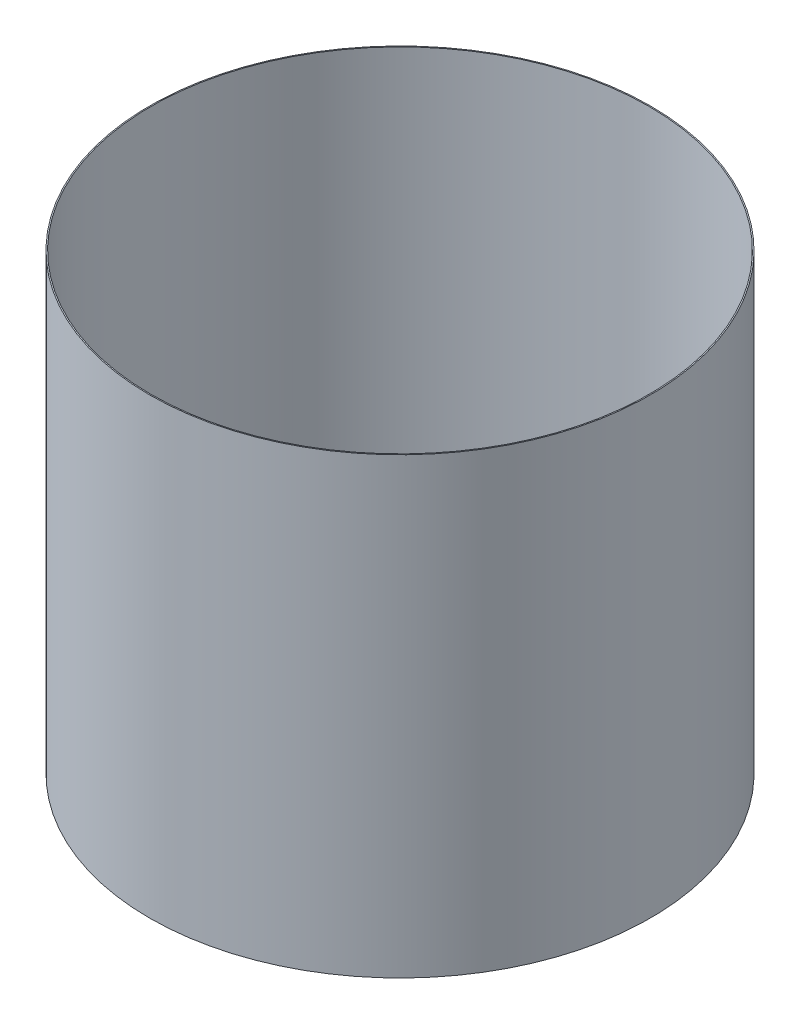
ISO-10303-21;
HEADER;
FILE_DESCRIPTION(('STEP AP214'),'2;1');
FILE_NAME('part.step','',(''),(''),'','','');
FILE_SCHEMA(('AUTOMOTIVE_DESIGN { 1 0 10303 214 1 1 1 1 }'));
ENDSEC;
DATA;
#1=APPLICATION_CONTEXT('core data for automotive mechanical design processes');
#2=APPLICATION_PROTOCOL_DEFINITION('international standard','automotive_design',2000,#1);
#3=PRODUCT_CONTEXT('',#1,'mechanical');
#4=PRODUCT('Part','Part','',(#3));
#5=PRODUCT_RELATED_PRODUCT_CATEGORY('part','',(#4));
#6=PRODUCT_DEFINITION_FORMATION('','',#4);
#7=PRODUCT_DEFINITION_CONTEXT('part definition',#1,'design');
#8=PRODUCT_DEFINITION('design','',#6,#7);
#9=PRODUCT_DEFINITION_SHAPE('','',#8);
#10=(LENGTH_UNIT() NAMED_UNIT(*) SI_UNIT(.MILLI.,.METRE.));
#11=(NAMED_UNIT(*) PLANE_ANGLE_UNIT() SI_UNIT($,.RADIAN.));
#12=(NAMED_UNIT(*) SI_UNIT($,.STERADIAN.) SOLID_ANGLE_UNIT());
#13=UNCERTAINTY_MEASURE_WITH_UNIT(LENGTH_MEASURE(1.E-05),#10,'distance_accuracy_value','');
#14=(GEOMETRIC_REPRESENTATION_CONTEXT(3) GLOBAL_UNCERTAINTY_ASSIGNED_CONTEXT((#13)) GLOBAL_UNIT_ASSIGNED_CONTEXT((#10,
#11,#12)) REPRESENTATION_CONTEXT('',''));
#15=CARTESIAN_POINT('',(0.,0.,0.));
#16=DIRECTION('',(0.,0.,1.));
#17=DIRECTION('',(1.,0.,0.));
#18=AXIS2_PLACEMENT_3D('',#15,#16,#17);
#19=CARTESIAN_POINT('',(-2.3,2.7,-2.5));
#20=DIRECTION('',(0.,-1.,0.));
#21=DIRECTION('',(0.,0.,-1.));
#22=AXIS2_PLACEMENT_3D('',#19,#20,#21);
#23=CYLINDRICAL_SURFACE('',#22,1.1);
#24=CARTESIAN_POINT('',(-2.3,0.7,-2.5));
#25=DIRECTION('',(0.,-1.,0.));
#26=DIRECTION('',(0.,0.,-1.));
#27=AXIS2_PLACEMENT_3D('',#24,#25,#26);
#28=CIRCLE('',#27,1.1);
#29=CARTESIAN_POINT('',(-2.3,0.7,-3.6));
#30=VERTEX_POINT('',#29);
#31=EDGE_CURVE('E28',#30,#30,#28,.T.);
#32=ORIENTED_EDGE('',*,*,#31,.T.);
#33=EDGE_LOOP('',(#32));
#34=FACE_BOUND('',#33,.T.);
#35=CARTESIAN_POINT('',(-2.3,2.7,-2.5));
#36=DIRECTION('',(0.,-1.,0.));
#37=DIRECTION('',(0.,0.,-1.));
#38=AXIS2_PLACEMENT_3D('',#35,#36,#37);
#39=CIRCLE('',#38,1.1);
#40=CARTESIAN_POINT('',(-2.3,2.7,-3.6));
#41=VERTEX_POINT('',#40);
#42=EDGE_CURVE('E19',#41,#41,#39,.T.);
#43=ORIENTED_EDGE('',*,*,#42,.F.);
#44=EDGE_LOOP('',(#43));
#45=FACE_BOUND('',#44,.T.);
#46=ADVANCED_FACE('F15',(#34,#45),#23,.F.);
#47=CARTESIAN_POINT('',(-3.418311069,2.7,-3.61826));
#48=DIRECTION('',(0.,1.,0.));
#49=DIRECTION('',(0.,0.,1.));
#50=AXIS2_PLACEMENT_3D('',#47,#48,#49);
#51=PLANE('',#50);
#52=ORIENTED_EDGE('',*,*,#42,.T.);
#53=EDGE_LOOP('',(#52));
#54=FACE_BOUND('',#53,.T.);
#55=CARTESIAN_POINT('',(-2.3,2.7,-2.5));
#56=DIRECTION('',(0.,-1.,0.));
#57=DIRECTION('',(0.,0.,-1.));
#58=AXIS2_PLACEMENT_3D('',#55,#56,#57);
#59=CIRCLE('',#58,1.105);
#60=CARTESIAN_POINT('',(-2.3,2.7,-3.605));
#61=VERTEX_POINT('',#60);
#62=EDGE_CURVE('E23',#61,#61,#59,.F.);
#63=ORIENTED_EDGE('',*,*,#62,.T.);
#64=EDGE_LOOP('',(#63));
#65=FACE_BOUND('',#64,.T.);
#66=ADVANCED_FACE('F36',(#54,#65),#51,.T.);
#67=CARTESIAN_POINT('',(-3.418311069,0.7,-3.61826));
#68=DIRECTION('',(0.,1.,0.));
#69=DIRECTION('',(0.,0.,1.));
#70=AXIS2_PLACEMENT_3D('',#67,#68,#69);
#71=PLANE('',#70);
#72=ORIENTED_EDGE('',*,*,#31,.F.);
#73=EDGE_LOOP('',(#72));
#74=FACE_BOUND('',#73,.T.);
#75=CARTESIAN_POINT('',(-2.3,0.700000000000001,-2.5));
#76=DIRECTION('',(0.,-1.,0.));
#77=DIRECTION('',(0.,0.,-1.));
#78=AXIS2_PLACEMENT_3D('',#75,#76,#77);
#79=CIRCLE('',#78,1.105);
#80=CARTESIAN_POINT('',(-2.3,0.700000000000001,-3.605));
#81=VERTEX_POINT('',#80);
#82=EDGE_CURVE('E10',#81,#81,#79,.T.);
#83=ORIENTED_EDGE('',*,*,#82,.T.);
#84=EDGE_LOOP('',(#83));
#85=FACE_BOUND('',#84,.T.);
#86=ADVANCED_FACE('F17',(#74,#85),#71,.F.);
#87=CARTESIAN_POINT('',(-2.3,2.7,-2.5));
#88=DIRECTION('',(0.,-1.,0.));
#89=DIRECTION('',(0.,0.,-1.));
#90=AXIS2_PLACEMENT_3D('',#87,#88,#89);
#91=CYLINDRICAL_SURFACE('',#90,1.105);
#92=ORIENTED_EDGE('',*,*,#82,.F.);
#93=EDGE_LOOP('',(#92));
#94=FACE_BOUND('',#93,.T.);
#95=ORIENTED_EDGE('',*,*,#62,.F.);
#96=EDGE_LOOP('',(#95));
#97=FACE_BOUND('',#96,.T.);
#98=ADVANCED_FACE('F46',(#94,#97),#91,.T.);
#99=CLOSED_SHELL('',(#46,#66,#86,#98));
#100=MANIFOLD_SOLID_BREP('B1',#99);
#101=ADVANCED_BREP_SHAPE_REPRESENTATION('',(#18,#100),#14);
#102=SHAPE_DEFINITION_REPRESENTATION(#9,#101);
ENDSEC;
END-ISO-10303-21;
